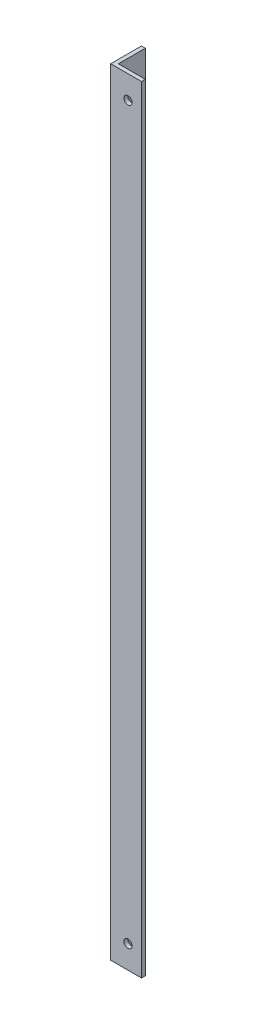
ISO-10303-21;
HEADER;
FILE_DESCRIPTION(('STEP AP214'),'2;1');
FILE_NAME('part.step','',(''),(''),'','','');
FILE_SCHEMA(('AUTOMOTIVE_DESIGN { 1 0 10303 214 1 1 1 1 }'));
ENDSEC;
DATA;
#1=APPLICATION_CONTEXT('core data for automotive mechanical design processes');
#2=APPLICATION_PROTOCOL_DEFINITION('international standard','automotive_design',2000,#1);
#3=PRODUCT_CONTEXT('',#1,'mechanical');
#4=PRODUCT('Part','Part','',(#3));
#5=PRODUCT_RELATED_PRODUCT_CATEGORY('part','',(#4));
#6=PRODUCT_DEFINITION_FORMATION('','',#4);
#7=PRODUCT_DEFINITION_CONTEXT('part definition',#1,'design');
#8=PRODUCT_DEFINITION('design','',#6,#7);
#9=PRODUCT_DEFINITION_SHAPE('','',#8);
#10=(LENGTH_UNIT() NAMED_UNIT(*) SI_UNIT(.MILLI.,.METRE.));
#11=(NAMED_UNIT(*) PLANE_ANGLE_UNIT() SI_UNIT($,.RADIAN.));
#12=(NAMED_UNIT(*) SI_UNIT($,.STERADIAN.) SOLID_ANGLE_UNIT());
#13=UNCERTAINTY_MEASURE_WITH_UNIT(LENGTH_MEASURE(1.E-05),#10,'distance_accuracy_value','');
#14=(GEOMETRIC_REPRESENTATION_CONTEXT(3) GLOBAL_UNCERTAINTY_ASSIGNED_CONTEXT((#13)) GLOBAL_UNIT_ASSIGNED_CONTEXT((#10,
#11,#12)) REPRESENTATION_CONTEXT('',''));
#15=CARTESIAN_POINT('',(0.,0.,0.));
#16=DIRECTION('',(0.,0.,1.));
#17=DIRECTION('',(1.,0.,0.));
#18=AXIS2_PLACEMENT_3D('',#15,#16,#17);
#19=CARTESIAN_POINT('',(-2.70893847012686E-13,4697.98318780426,-1.2490009027033E-13));
#20=DIRECTION('',(0.,-1.,0.));
#21=DIRECTION('',(0.964326147917118,0.,0.26471698178117));
#22=AXIS2_PLACEMENT_3D('',#19,#20,#21);
#23=PLANE('',#22);
#24=DIRECTION('',(0.,0.,1.));
#25=VECTOR('',#24,1.);
#26=CARTESIAN_POINT('',(-3.212623577969E-13,4697.98318780426,-9.26415744040256));
#27=LINE('',#26,#25);
#28=CARTESIAN_POINT('',(-4.2332746829372E-13,4697.98318780426,-25.4000000000004));
#29=VERTEX_POINT('',#28);
#30=CARTESIAN_POINT('',(-1.76969493025665E-12,4697.98318780426,-3.46944695195361E-13));
#31=VERTEX_POINT('',#30);
#32=EDGE_CURVE('E134',#29,#31,#27,.T.);
#33=ORIENTED_EDGE('',*,*,#32,.F.);
#34=DIRECTION('',(-1.,0.,0.));
#35=VECTOR('',#34,1.);
#36=CARTESIAN_POINT('',(3.47928548599299,4697.98318780426,-25.4000000000007));
#37=LINE('',#36,#35);
#38=CARTESIAN_POINT('',(3.17500000000023,4697.98318780426,-25.4000000000002));
#39=VERTEX_POINT('',#38);
#40=EDGE_CURVE('E124',#39,#29,#37,.T.);
#41=ORIENTED_EDGE('',*,*,#40,.F.);
#42=DIRECTION('',(0.,0.,-1.));
#43=VECTOR('',#42,1.);
#44=CARTESIAN_POINT('',(3.17499999999988,4697.98318780426,-7.24450947344692));
#45=LINE('',#44,#43);
#46=CARTESIAN_POINT('',(3.17499999999971,4697.98318780426,-3.17500000000027));
#47=VERTEX_POINT('',#46);
#48=EDGE_CURVE('E133',#47,#39,#45,.T.);
#49=ORIENTED_EDGE('',*,*,#48,.F.);
#50=DIRECTION('',(-1.,0.,0.));
#51=VECTOR('',#50,1.);
#52=CARTESIAN_POINT('',(37.7288822935268,4697.98318780426,-3.17500000000027));
#53=LINE('',#52,#51);
#54=CARTESIAN_POINT('',(25.3999999999998,4697.98318780426,-3.17500000000027));
#55=VERTEX_POINT('',#54);
#56=EDGE_CURVE('E196',#55,#47,#53,.T.);
#57=ORIENTED_EDGE('',*,*,#56,.F.);
#58=DIRECTION('',(0.,0.,-1.));
#59=VECTOR('',#58,1.);
#60=CARTESIAN_POINT('',(25.3999999999995,4697.98318780426,1.99446789168177));
#61=LINE('',#60,#59);
#62=CARTESIAN_POINT('',(25.3999999999985,4697.98318780426,-3.46944695195361E-13));
#63=VERTEX_POINT('',#62);
#64=EDGE_CURVE('E193',#63,#55,#61,.T.);
#65=ORIENTED_EDGE('',*,*,#64,.F.);
#66=DIRECTION('',(1.,0.,0.));
#67=VECTOR('',#66,1.);
#68=CARTESIAN_POINT('',(1023.22734869566,4697.98318780426,5.41233724504764E-13));
#69=LINE('',#68,#67);
#70=EDGE_CURVE('E138',#31,#63,#69,.T.);
#71=ORIENTED_EDGE('',*,*,#70,.F.);
#72=EDGE_LOOP('',(#33,#41,#49,#57,#65,#71));
#73=FACE_BOUND('',#72,.T.);
#74=ADVANCED_FACE('F50',(#73),#23,.T.);
#75=CARTESIAN_POINT('',(3.47928548599341,323.969932125539,-25.4000000000006));
#76=DIRECTION('',(0.,0.,-1.));
#77=DIRECTION('',(-1.,0.,0.));
#78=AXIS2_PLACEMENT_3D('',#75,#76,#77);
#79=PLANE('',#78);
#80=DIRECTION('',(0.,1.,0.));
#81=VECTOR('',#80,1.);
#82=CARTESIAN_POINT('',(3.17500000000059,323.969932125538,-25.4000000000001));
#83=LINE('',#82,#81);
#84=CARTESIAN_POINT('',(3.17500000000035,5339.2174578054,-25.4000000000002));
#85=VERTEX_POINT('',#84);
#86=EDGE_CURVE('E72',#39,#85,#83,.T.);
#87=ORIENTED_EDGE('',*,*,#86,.F.);
#88=ORIENTED_EDGE('',*,*,#40,.T.);
#89=DIRECTION('',(0.,1.,0.));
#90=VECTOR('',#89,1.);
#91=CARTESIAN_POINT('',(0.,323.969932125539,-25.4000000000006));
#92=LINE('',#91,#90);
#93=CARTESIAN_POINT('',(-3.02220964878658E-13,5339.2174578054,-25.4000000000002));
#94=VERTEX_POINT('',#93);
#95=EDGE_CURVE('E128',#29,#94,#92,.T.);
#96=ORIENTED_EDGE('',*,*,#95,.T.);
#97=DIRECTION('',(1.,0.,0.));
#98=VECTOR('',#97,1.);
#99=CARTESIAN_POINT('',(3.47928548599416,5339.2174578054,-25.4000000000002));
#100=LINE('',#99,#98);
#101=EDGE_CURVE('E11',#94,#85,#100,.T.);
#102=ORIENTED_EDGE('',*,*,#101,.T.);
#103=EDGE_LOOP('',(#87,#88,#96,#102));
#104=FACE_BOUND('',#103,.T.);
#105=ADVANCED_FACE('F126',(#104),#79,.T.);
#106=CARTESIAN_POINT('',(3.17500000000025,323.969932125538,-7.24450947344737));
#107=DIRECTION('',(1.,0.,0.));
#108=DIRECTION('',(0.,0.,-1.));
#109=AXIS2_PLACEMENT_3D('',#106,#107,#108);
#110=PLANE('',#109);
#111=DIRECTION('',(0.,1.,0.));
#112=VECTOR('',#111,1.);
#113=CARTESIAN_POINT('',(3.17500000000014,323.969932125539,-3.17500000000079));
#114=LINE('',#113,#112);
#115=CARTESIAN_POINT('',(3.17499999999984,5339.2174578054,-3.1750000000005));
#116=VERTEX_POINT('',#115);
#117=EDGE_CURVE('E82',#47,#116,#114,.T.);
#118=ORIENTED_EDGE('',*,*,#117,.F.);
#119=ORIENTED_EDGE('',*,*,#48,.T.);
#120=ORIENTED_EDGE('',*,*,#86,.T.);
#121=DIRECTION('',(0.,0.,1.));
#122=VECTOR('',#121,1.);
#123=CARTESIAN_POINT('',(3.17499999999995,5339.2174578054,-7.2445094734467));
#124=LINE('',#123,#122);
#125=EDGE_CURVE('E60',#85,#116,#124,.T.);
#126=ORIENTED_EDGE('',*,*,#125,.T.);
#127=EDGE_LOOP('',(#118,#119,#120,#126));
#128=FACE_BOUND('',#127,.T.);
#129=ADVANCED_FACE('F248',(#128),#110,.T.);
#130=CARTESIAN_POINT('',(37.7288822935272,323.969932125538,-3.1750000000003));
#131=DIRECTION('',(0.,0.,-1.));
#132=DIRECTION('',(-1.,0.,0.));
#133=AXIS2_PLACEMENT_3D('',#130,#131,#132);
#134=PLANE('',#133);
#135=CARTESIAN_POINT('',(14.2875,5320.1674578054,-3.17500000000094));
#136=DIRECTION('',(0.,0.,-1.));
#137=DIRECTION('',(-1.,0.,0.));
#138=AXIS2_PLACEMENT_3D('',#135,#136,#137);
#139=CIRCLE('',#138,3.37820000000005);
#140=CARTESIAN_POINT('',(10.9092999999999,5320.1674578054,-3.17500000000094));
#141=VERTEX_POINT('',#140);
#142=EDGE_CURVE('E163',#141,#141,#139,.F.);
#143=ORIENTED_EDGE('',*,*,#142,.T.);
#144=EDGE_LOOP('',(#143));
#145=FACE_BOUND('',#144,.T.);
#146=CARTESIAN_POINT('',(14.2874999999999,4717.03318780426,-3.17500000000094));
#147=DIRECTION('',(0.,0.,-1.));
#148=DIRECTION('',(-1.,0.,0.));
#149=AXIS2_PLACEMENT_3D('',#146,#147,#148);
#150=CIRCLE('',#149,3.37820000000005);
#151=CARTESIAN_POINT('',(10.9092999999999,4717.03318780426,-3.17500000000094));
#152=VERTEX_POINT('',#151);
#153=EDGE_CURVE('E142',#152,#152,#150,.F.);
#154=ORIENTED_EDGE('',*,*,#153,.T.);
#155=EDGE_LOOP('',(#154));
#156=FACE_BOUND('',#155,.T.);
#157=DIRECTION('',(0.,1.,0.));
#158=VECTOR('',#157,1.);
#159=CARTESIAN_POINT('',(25.3999999999997,323.969932125538,-3.17500000000054));
#160=LINE('',#159,#158);
#161=CARTESIAN_POINT('',(25.3999999999994,5339.2174578054,-3.1750000000005));
#162=VERTEX_POINT('',#161);
#163=EDGE_CURVE('E205',#55,#162,#160,.T.);
#164=ORIENTED_EDGE('',*,*,#163,.F.);
#165=ORIENTED_EDGE('',*,*,#56,.T.);
#166=ORIENTED_EDGE('',*,*,#117,.T.);
#167=DIRECTION('',(1.,0.,0.));
#168=VECTOR('',#167,1.);
#169=CARTESIAN_POINT('',(37.728882293528,5339.2174578054,-3.1750000000005));
#170=LINE('',#169,#168);
#171=EDGE_CURVE('E183',#116,#162,#170,.T.);
#172=ORIENTED_EDGE('',*,*,#171,.T.);
#173=EDGE_LOOP('',(#164,#165,#166,#172));
#174=FACE_BOUND('',#173,.T.);
#175=ADVANCED_FACE('F222',(#145,#156,#174),#134,.T.);
#176=CARTESIAN_POINT('',(166.234228507342,5339.21745780539,12.7019999999999));
#177=DIRECTION('',(0.,1.,0.));
#178=DIRECTION('',(0.26471698178117,0.,-0.964326147917118));
#179=AXIS2_PLACEMENT_3D('',#176,#177,#178);
#180=PLANE('',#179);
#181=ORIENTED_EDGE('',*,*,#101,.F.);
#182=DIRECTION('',(0.,0.,-1.));
#183=VECTOR('',#182,1.);
#184=CARTESIAN_POINT('',(-2.55667005613097E-13,5339.2174578054,-9.26415744040256));
#185=LINE('',#184,#183);
#186=CARTESIAN_POINT('',(-1.64858842684159E-12,5339.2174578054,-3.46944695195361E-13));
#187=VERTEX_POINT('',#186);
#188=EDGE_CURVE('E146',#187,#94,#185,.T.);
#189=ORIENTED_EDGE('',*,*,#188,.F.);
#190=DIRECTION('',(-1.,0.,0.));
#191=VECTOR('',#190,1.);
#192=CARTESIAN_POINT('',(1023.22734869566,5339.2174578054,0.));
#193=LINE('',#192,#191);
#194=CARTESIAN_POINT('',(25.3999999999986,5339.2174578054,-1.2490009027033E-13));
#195=VERTEX_POINT('',#194);
#196=EDGE_CURVE('E149',#195,#187,#193,.T.);
#197=ORIENTED_EDGE('',*,*,#196,.F.);
#198=DIRECTION('',(0.,0.,1.));
#199=VECTOR('',#198,1.);
#200=CARTESIAN_POINT('',(25.3999999999995,5339.2174578054,1.99446789168221));
#201=LINE('',#200,#199);
#202=EDGE_CURVE('E185',#162,#195,#201,.T.);
#203=ORIENTED_EDGE('',*,*,#202,.F.);
#204=ORIENTED_EDGE('',*,*,#171,.F.);
#205=ORIENTED_EDGE('',*,*,#125,.F.);
#206=EDGE_LOOP('',(#181,#189,#197,#203,#204,#205));
#207=FACE_BOUND('',#206,.T.);
#208=ADVANCED_FACE('F295',(#207),#180,.T.);
#209=CARTESIAN_POINT('',(25.3999999999998,323.969932125538,1.99446789168183));
#210=DIRECTION('',(1.,0.,0.));
#211=DIRECTION('',(0.,0.,-1.));
#212=AXIS2_PLACEMENT_3D('',#209,#210,#211);
#213=PLANE('',#212);
#214=DIRECTION('',(0.,1.,0.));
#215=VECTOR('',#214,1.);
#216=CARTESIAN_POINT('',(25.3999999999989,323.969932125538,-3.33066907387547E-13));
#217=LINE('',#216,#215);
#218=EDGE_CURVE('E202',#63,#195,#217,.T.);
#219=ORIENTED_EDGE('',*,*,#218,.F.);
#220=ORIENTED_EDGE('',*,*,#64,.T.);
#221=ORIENTED_EDGE('',*,*,#163,.T.);
#222=ORIENTED_EDGE('',*,*,#202,.T.);
#223=EDGE_LOOP('',(#219,#220,#221,#222));
#224=FACE_BOUND('',#223,.T.);
#225=ADVANCED_FACE('F285',(#224),#213,.T.);
#226=CARTESIAN_POINT('',(0.,323.969932125539,-9.26415744040308));
#227=DIRECTION('',(-1.,0.,0.));
#228=DIRECTION('',(0.,0.,1.));
#229=AXIS2_PLACEMENT_3D('',#226,#227,#228);
#230=PLANE('',#229);
#231=ORIENTED_EDGE('',*,*,#95,.F.);
#232=ORIENTED_EDGE('',*,*,#32,.T.);
#233=DIRECTION('',(0.,1.,0.));
#234=VECTOR('',#233,1.);
#235=CARTESIAN_POINT('',(-1.34880446887026E-12,323.969932125538,-3.46944695195361E-13));
#236=LINE('',#235,#234);
#237=EDGE_CURVE('E192',#31,#187,#236,.T.);
#238=ORIENTED_EDGE('',*,*,#237,.T.);
#239=ORIENTED_EDGE('',*,*,#188,.T.);
#240=EDGE_LOOP('',(#231,#232,#238,#239));
#241=FACE_BOUND('',#240,.T.);
#242=ADVANCED_FACE('F144',(#241),#230,.T.);
#243=CARTESIAN_POINT('',(1023.22734869566,323.969932125538,0.));
#244=DIRECTION('',(0.,0.,1.));
#245=DIRECTION('',(1.,0.,0.));
#246=AXIS2_PLACEMENT_3D('',#243,#244,#245);
#247=PLANE('',#246);
#248=CARTESIAN_POINT('',(14.2874999999996,5320.1674578054,-5.68989300120393E-13));
#249=DIRECTION('',(0.,0.,1.));
#250=DIRECTION('',(1.,0.,0.));
#251=AXIS2_PLACEMENT_3D('',#248,#249,#250);
#252=CIRCLE('',#251,3.37820000000005);
#253=CARTESIAN_POINT('',(17.6656999999996,5320.1674578054,-5.68860349508766E-13));
#254=VERTEX_POINT('',#253);
#255=EDGE_CURVE('E54',#254,#254,#252,.F.);
#256=ORIENTED_EDGE('',*,*,#255,.T.);
#257=EDGE_LOOP('',(#256));
#258=FACE_BOUND('',#257,.T.);
#259=CARTESIAN_POINT('',(14.2874999999995,4717.03318780426,-5.68989300120393E-13));
#260=DIRECTION('',(0.,0.,1.));
#261=DIRECTION('',(1.,0.,0.));
#262=AXIS2_PLACEMENT_3D('',#259,#260,#261);
#263=CIRCLE('',#262,3.37820000000005);
#264=CARTESIAN_POINT('',(17.6656999999996,4717.03318780426,-5.68860349508766E-13));
#265=VERTEX_POINT('',#264);
#266=EDGE_CURVE('E160',#265,#265,#263,.F.);
#267=ORIENTED_EDGE('',*,*,#266,.T.);
#268=EDGE_LOOP('',(#267));
#269=FACE_BOUND('',#268,.T.);
#270=ORIENTED_EDGE('',*,*,#237,.F.);
#271=ORIENTED_EDGE('',*,*,#70,.T.);
#272=ORIENTED_EDGE('',*,*,#218,.T.);
#273=ORIENTED_EDGE('',*,*,#196,.T.);
#274=EDGE_LOOP('',(#270,#271,#272,#273));
#275=FACE_BOUND('',#274,.T.);
#276=ADVANCED_FACE('F52',(#258,#269,#275),#247,.T.);
#277=CARTESIAN_POINT('',(14.2875000000024,4717.03318780426,-3553.21699062703));
#278=DIRECTION('',(0.,0.,1.));
#279=DIRECTION('',(1.,0.,0.));
#280=AXIS2_PLACEMENT_3D('',#277,#278,#279);
#281=CYLINDRICAL_SURFACE('',#280,3.37820000000005);
#282=ORIENTED_EDGE('',*,*,#153,.F.);
#283=EDGE_LOOP('',(#282));
#284=FACE_BOUND('',#283,.T.);
#285=ORIENTED_EDGE('',*,*,#266,.F.);
#286=EDGE_LOOP('',(#285));
#287=FACE_BOUND('',#286,.T.);
#288=ADVANCED_FACE('F232',(#284,#287),#281,.F.);
#289=CARTESIAN_POINT('',(14.2875000000024,5320.1674578054,-3553.21699062703));
#290=DIRECTION('',(0.,0.,1.));
#291=DIRECTION('',(1.,0.,0.));
#292=AXIS2_PLACEMENT_3D('',#289,#290,#291);
#293=CYLINDRICAL_SURFACE('',#292,3.37820000000005);
#294=ORIENTED_EDGE('',*,*,#142,.F.);
#295=EDGE_LOOP('',(#294));
#296=FACE_BOUND('',#295,.T.);
#297=ORIENTED_EDGE('',*,*,#255,.F.);
#298=EDGE_LOOP('',(#297));
#299=FACE_BOUND('',#298,.T.);
#300=ADVANCED_FACE('F228',(#296,#299),#293,.F.);
#301=CLOSED_SHELL('',(#74,#105,#129,#175,#208,#225,#242,#276,#288,#300));
#302=MANIFOLD_SOLID_BREP('B2',#301);
#303=ADVANCED_BREP_SHAPE_REPRESENTATION('',(#18,#302),#14);
#304=SHAPE_DEFINITION_REPRESENTATION(#9,#303);
ENDSEC;
END-ISO-10303-21;
